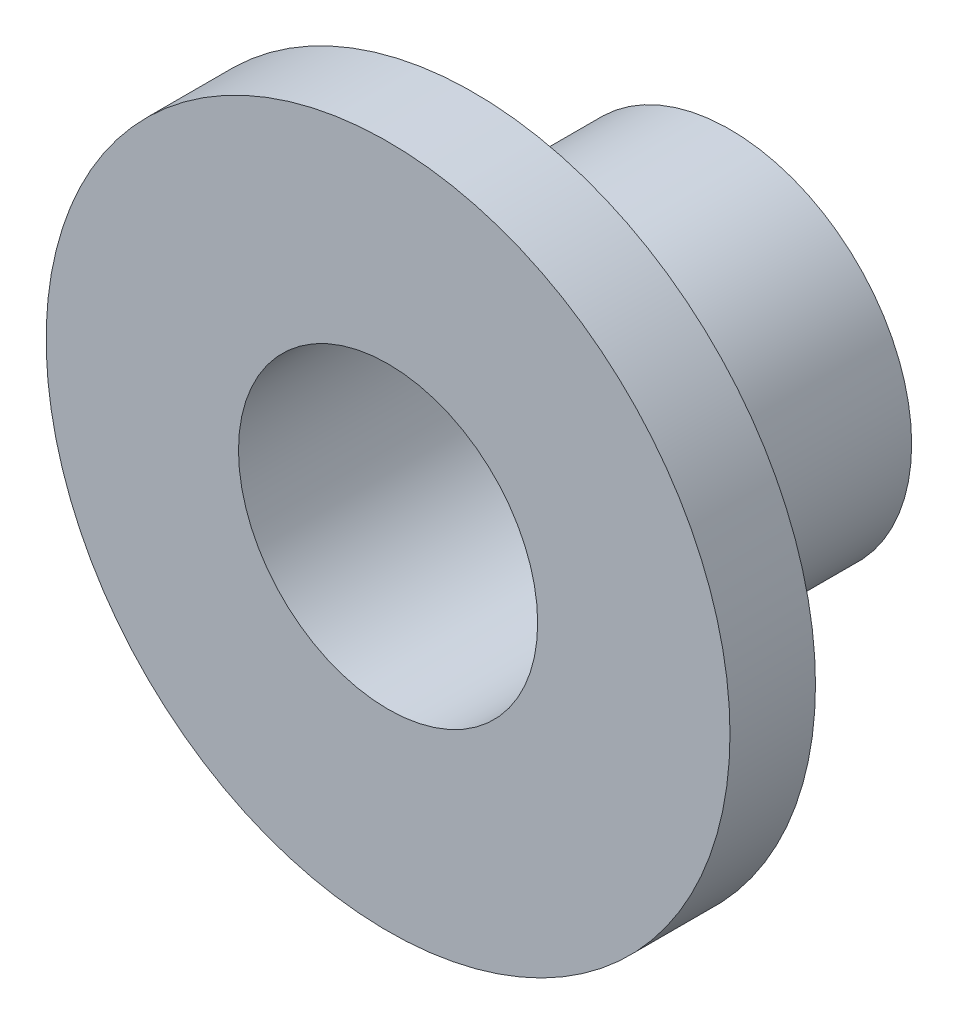
ISO-10303-21;
HEADER;
FILE_DESCRIPTION(('STEP AP214'),'2;1');
FILE_NAME('part.step','',(''),(''),'','','');
FILE_SCHEMA(('AUTOMOTIVE_DESIGN { 1 0 10303 214 1 1 1 1 }'));
ENDSEC;
DATA;
#1=APPLICATION_CONTEXT('core data for automotive mechanical design processes');
#2=APPLICATION_PROTOCOL_DEFINITION('international standard','automotive_design',2000,#1);
#3=PRODUCT_CONTEXT('',#1,'mechanical');
#4=PRODUCT('Part','Part','',(#3));
#5=PRODUCT_RELATED_PRODUCT_CATEGORY('part','',(#4));
#6=PRODUCT_DEFINITION_FORMATION('','',#4);
#7=PRODUCT_DEFINITION_CONTEXT('part definition',#1,'design');
#8=PRODUCT_DEFINITION('design','',#6,#7);
#9=PRODUCT_DEFINITION_SHAPE('','',#8);
#10=(LENGTH_UNIT() NAMED_UNIT(*) SI_UNIT(.MILLI.,.METRE.));
#11=(NAMED_UNIT(*) PLANE_ANGLE_UNIT() SI_UNIT($,.RADIAN.));
#12=(NAMED_UNIT(*) SI_UNIT($,.STERADIAN.) SOLID_ANGLE_UNIT());
#13=UNCERTAINTY_MEASURE_WITH_UNIT(LENGTH_MEASURE(1.E-05),#10,'distance_accuracy_value','');
#14=(GEOMETRIC_REPRESENTATION_CONTEXT(3) GLOBAL_UNCERTAINTY_ASSIGNED_CONTEXT((#13)) GLOBAL_UNIT_ASSIGNED_CONTEXT((#10,
#11,#12)) REPRESENTATION_CONTEXT('',''));
#15=CARTESIAN_POINT('',(0.,0.,0.));
#16=DIRECTION('',(0.,0.,1.));
#17=DIRECTION('',(1.,0.,0.));
#18=AXIS2_PLACEMENT_3D('',#15,#16,#17);
#19=CARTESIAN_POINT('',(0.,0.,0.));
#20=DIRECTION('',(0.,0.,1.));
#21=DIRECTION('',(1.,0.,0.));
#22=AXIS2_PLACEMENT_3D('',#19,#20,#21);
#23=PLANE('',#22);
#24=CARTESIAN_POINT('',(0.,0.,0.));
#25=DIRECTION('',(0.,0.,1.));
#26=DIRECTION('',(1.,0.,0.));
#27=AXIS2_PLACEMENT_3D('',#24,#25,#26);
#28=CIRCLE('',#27,2.125);
#29=CARTESIAN_POINT('',(2.125,0.,0.));
#30=VERTEX_POINT('',#29);
#31=EDGE_CURVE('E41',#30,#30,#28,.T.);
#32=ORIENTED_EDGE('',*,*,#31,.F.);
#33=EDGE_LOOP('',(#32));
#34=FACE_BOUND('',#33,.T.);
#35=CARTESIAN_POINT('',(0.,0.,0.));
#36=DIRECTION('',(0.,0.,1.));
#37=DIRECTION('',(1.,0.,0.));
#38=AXIS2_PLACEMENT_3D('',#35,#36,#37);
#39=CIRCLE('',#38,1.75);
#40=CARTESIAN_POINT('',(1.75,0.,0.));
#41=VERTEX_POINT('',#40);
#42=EDGE_CURVE('E48',#41,#41,#39,.T.);
#43=ORIENTED_EDGE('',*,*,#42,.T.);
#44=EDGE_LOOP('',(#43));
#45=FACE_BOUND('',#44,.T.);
#46=ADVANCED_FACE('F37',(#34,#45),#23,.F.);
#47=CARTESIAN_POINT('',(0.,0.,3.));
#48=DIRECTION('',(0.,0.,-1.));
#49=DIRECTION('',(-1.,0.,0.));
#50=AXIS2_PLACEMENT_3D('',#47,#48,#49);
#51=CYLINDRICAL_SURFACE('',#50,2.125);
#52=CARTESIAN_POINT('',(0.,0.,3.));
#53=DIRECTION('',(0.,0.,1.));
#54=DIRECTION('',(1.,0.,0.));
#55=AXIS2_PLACEMENT_3D('',#52,#53,#54);
#56=CIRCLE('',#55,2.125);
#57=CARTESIAN_POINT('',(2.125,0.,3.));
#58=VERTEX_POINT('',#57);
#59=EDGE_CURVE('E10',#58,#58,#56,.T.);
#60=ORIENTED_EDGE('',*,*,#59,.F.);
#61=EDGE_LOOP('',(#60));
#62=FACE_BOUND('',#61,.T.);
#63=ORIENTED_EDGE('',*,*,#31,.T.);
#64=EDGE_LOOP('',(#63));
#65=FACE_BOUND('',#64,.T.);
#66=ADVANCED_FACE('F39',(#62,#65),#51,.T.);
#67=CARTESIAN_POINT('',(0.,0.,3.));
#68=DIRECTION('',(0.,0.,-1.));
#69=DIRECTION('',(-1.,0.,0.));
#70=AXIS2_PLACEMENT_3D('',#67,#68,#69);
#71=CYLINDRICAL_SURFACE('',#70,1.75);
#72=ORIENTED_EDGE('',*,*,#42,.F.);
#73=EDGE_LOOP('',(#72));
#74=FACE_BOUND('',#73,.T.);
#75=CARTESIAN_POINT('',(0.,0.,4.));
#76=DIRECTION('',(0.,0.,1.));
#77=DIRECTION('',(1.,0.,0.));
#78=AXIS2_PLACEMENT_3D('',#75,#76,#77);
#79=CIRCLE('',#78,1.75);
#80=CARTESIAN_POINT('',(1.75,0.,4.));
#81=VERTEX_POINT('',#80);
#82=EDGE_CURVE('E56',#81,#81,#79,.T.);
#83=ORIENTED_EDGE('',*,*,#82,.T.);
#84=EDGE_LOOP('',(#83));
#85=FACE_BOUND('',#84,.T.);
#86=ADVANCED_FACE('F62',(#74,#85),#71,.F.);
#87=CARTESIAN_POINT('',(0.,0.,4.));
#88=DIRECTION('',(0.,0.,1.));
#89=DIRECTION('',(1.,0.,0.));
#90=AXIS2_PLACEMENT_3D('',#87,#88,#89);
#91=PLANE('',#90);
#92=CARTESIAN_POINT('',(0.,0.,4.));
#93=DIRECTION('',(0.,0.,1.));
#94=DIRECTION('',(1.,0.,0.));
#95=AXIS2_PLACEMENT_3D('',#92,#93,#94);
#96=CIRCLE('',#95,4.);
#97=CARTESIAN_POINT('',(4.,0.,4.));
#98=VERTEX_POINT('',#97);
#99=EDGE_CURVE('E52',#98,#98,#96,.T.);
#100=ORIENTED_EDGE('',*,*,#99,.T.);
#101=EDGE_LOOP('',(#100));
#102=FACE_BOUND('',#101,.T.);
#103=ORIENTED_EDGE('',*,*,#82,.F.);
#104=EDGE_LOOP('',(#103));
#105=FACE_BOUND('',#104,.T.);
#106=ADVANCED_FACE('F64',(#102,#105),#91,.T.);
#107=CARTESIAN_POINT('',(0.,0.,3.));
#108=DIRECTION('',(0.,0.,1.));
#109=DIRECTION('',(1.,0.,0.));
#110=AXIS2_PLACEMENT_3D('',#107,#108,#109);
#111=PLANE('',#110);
#112=ORIENTED_EDGE('',*,*,#59,.T.);
#113=EDGE_LOOP('',(#112));
#114=FACE_BOUND('',#113,.T.);
#115=CARTESIAN_POINT('',(0.,0.,3.));
#116=DIRECTION('',(0.,0.,1.));
#117=DIRECTION('',(1.,0.,0.));
#118=AXIS2_PLACEMENT_3D('',#115,#116,#117);
#119=CIRCLE('',#118,4.);
#120=CARTESIAN_POINT('',(4.,0.,3.));
#121=VERTEX_POINT('',#120);
#122=EDGE_CURVE('E53',#121,#121,#119,.T.);
#123=ORIENTED_EDGE('',*,*,#122,.F.);
#124=EDGE_LOOP('',(#123));
#125=FACE_BOUND('',#124,.T.);
#126=ADVANCED_FACE('F66',(#114,#125),#111,.F.);
#127=CARTESIAN_POINT('',(0.,0.,4.));
#128=DIRECTION('',(0.,0.,-1.));
#129=DIRECTION('',(-1.,0.,0.));
#130=AXIS2_PLACEMENT_3D('',#127,#128,#129);
#131=CYLINDRICAL_SURFACE('',#130,4.);
#132=ORIENTED_EDGE('',*,*,#99,.F.);
#133=EDGE_LOOP('',(#132));
#134=FACE_BOUND('',#133,.T.);
#135=ORIENTED_EDGE('',*,*,#122,.T.);
#136=EDGE_LOOP('',(#135));
#137=FACE_BOUND('',#136,.T.);
#138=ADVANCED_FACE('F73',(#134,#137),#131,.T.);
#139=CLOSED_SHELL('',(#46,#66,#86,#106,#126,#138));
#140=MANIFOLD_SOLID_BREP('B2',#139);
#141=ADVANCED_BREP_SHAPE_REPRESENTATION('',(#18,#140),#14);
#142=SHAPE_DEFINITION_REPRESENTATION(#9,#141);
ENDSEC;
END-ISO-10303-21;
